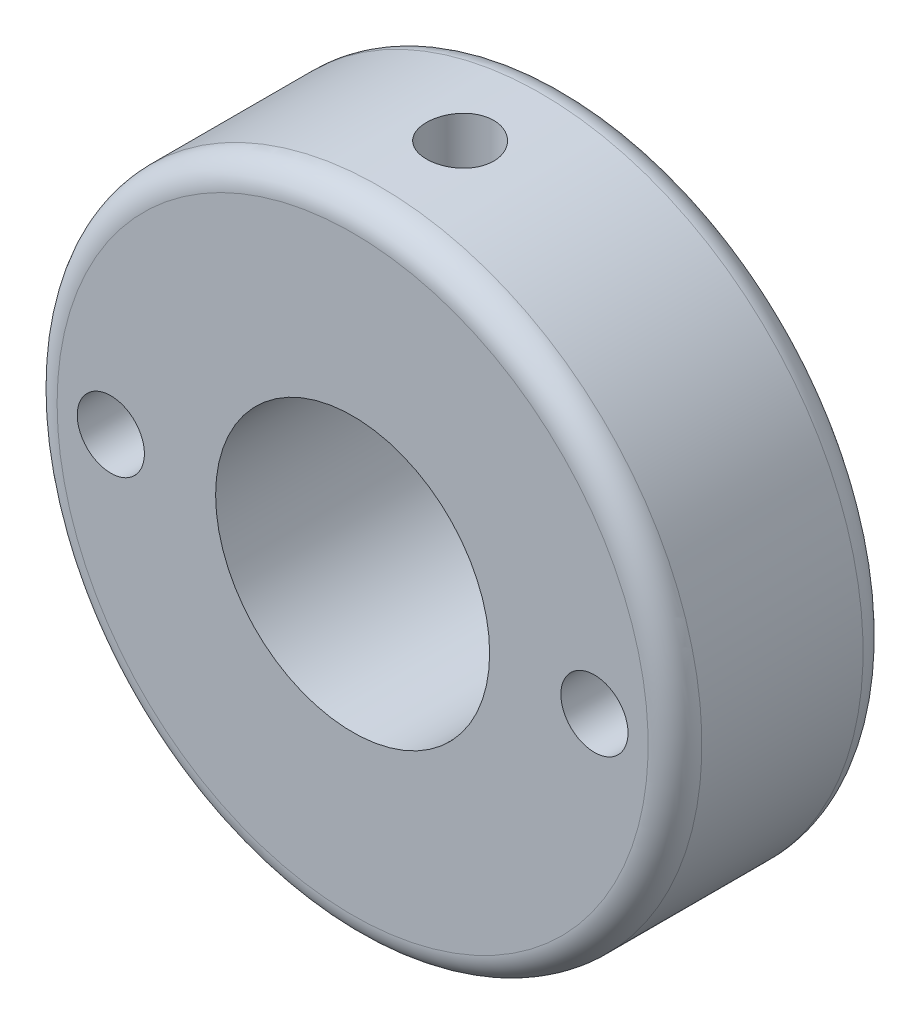
ISO-10303-21;
HEADER;
FILE_DESCRIPTION(('STEP AP214'),'2;1');
FILE_NAME('part.step','',(''),(''),'','','');
FILE_SCHEMA(('AUTOMOTIVE_DESIGN { 1 0 10303 214 1 1 1 1 }'));
ENDSEC;
DATA;
#1=APPLICATION_CONTEXT('core data for automotive mechanical design processes');
#2=APPLICATION_PROTOCOL_DEFINITION('international standard','automotive_design',2000,#1);
#3=PRODUCT_CONTEXT('',#1,'mechanical');
#4=PRODUCT('Part','Part','',(#3));
#5=PRODUCT_RELATED_PRODUCT_CATEGORY('part','',(#4));
#6=PRODUCT_DEFINITION_FORMATION('','',#4);
#7=PRODUCT_DEFINITION_CONTEXT('part definition',#1,'design');
#8=PRODUCT_DEFINITION('design','',#6,#7);
#9=PRODUCT_DEFINITION_SHAPE('','',#8);
#10=(LENGTH_UNIT() NAMED_UNIT(*) SI_UNIT(.MILLI.,.METRE.));
#11=(NAMED_UNIT(*) PLANE_ANGLE_UNIT() SI_UNIT($,.RADIAN.));
#12=(NAMED_UNIT(*) SI_UNIT($,.STERADIAN.) SOLID_ANGLE_UNIT());
#13=UNCERTAINTY_MEASURE_WITH_UNIT(LENGTH_MEASURE(1.E-05),#10,'distance_accuracy_value','');
#14=(GEOMETRIC_REPRESENTATION_CONTEXT(3) GLOBAL_UNCERTAINTY_ASSIGNED_CONTEXT((#13)) GLOBAL_UNIT_ASSIGNED_CONTEXT((#10,
#11,#12)) REPRESENTATION_CONTEXT('',''));
#15=CARTESIAN_POINT('',(0.,0.,0.));
#16=DIRECTION('',(0.,0.,1.));
#17=DIRECTION('',(1.,0.,0.));
#18=AXIS2_PLACEMENT_3D('',#15,#16,#17);
#19=CARTESIAN_POINT('',(0.,0.,0.));
#20=DIRECTION('',(0.,0.,-1.));
#21=DIRECTION('',(-1.,0.,0.));
#22=AXIS2_PLACEMENT_3D('',#19,#20,#21);
#23=PLANE('',#22);
#24=CARTESIAN_POINT('',(0.,0.,0.));
#25=DIRECTION('',(0.,0.,-1.));
#26=DIRECTION('',(-1.,0.,0.));
#27=AXIS2_PLACEMENT_3D('',#24,#25,#26);
#28=CIRCLE('',#27,11.);
#29=CARTESIAN_POINT('',(-11.,0.,0.));
#30=VERTEX_POINT('',#29);
#31=EDGE_CURVE('E50',#30,#30,#28,.T.);
#32=ORIENTED_EDGE('',*,*,#31,.T.);
#33=EDGE_LOOP('',(#32));
#34=FACE_BOUND('',#33,.T.);
#35=CARTESIAN_POINT('',(0.,0.,0.));
#36=DIRECTION('',(0.,0.,-1.));
#37=DIRECTION('',(-1.,0.,0.));
#38=AXIS2_PLACEMENT_3D('',#35,#36,#37);
#39=CIRCLE('',#38,5.09999999999999);
#40=CARTESIAN_POINT('',(-5.09999999999999,0.,0.));
#41=VERTEX_POINT('',#40);
#42=EDGE_CURVE('E106',#41,#41,#39,.T.);
#43=ORIENTED_EDGE('',*,*,#42,.F.);
#44=EDGE_LOOP('',(#43));
#45=FACE_BOUND('',#44,.T.);
#46=CARTESIAN_POINT('',(9.,0.,0.));
#47=DIRECTION('',(0.,0.,1.));
#48=DIRECTION('',(1.,0.,0.));
#49=AXIS2_PLACEMENT_3D('',#46,#47,#48);
#50=CIRCLE('',#49,1.25);
#51=CARTESIAN_POINT('',(10.25,0.,0.));
#52=VERTEX_POINT('',#51);
#53=EDGE_CURVE('E115',#52,#52,#50,.T.);
#54=ORIENTED_EDGE('',*,*,#53,.T.);
#55=EDGE_LOOP('',(#54));
#56=FACE_BOUND('',#55,.T.);
#57=CARTESIAN_POINT('',(-9.,0.,0.));
#58=DIRECTION('',(0.,0.,1.));
#59=DIRECTION('',(1.,0.,0.));
#60=AXIS2_PLACEMENT_3D('',#57,#58,#59);
#61=CIRCLE('',#60,1.25);
#62=CARTESIAN_POINT('',(-7.75,0.,0.));
#63=VERTEX_POINT('',#62);
#64=EDGE_CURVE('E63',#63,#63,#61,.T.);
#65=ORIENTED_EDGE('',*,*,#64,.T.);
#66=EDGE_LOOP('',(#65));
#67=FACE_BOUND('',#66,.T.);
#68=ADVANCED_FACE('F35',(#34,#45,#56,#67),#23,.T.);
#69=CARTESIAN_POINT('',(0.,0.,8.));
#70=DIRECTION('',(0.,0.,-1.));
#71=DIRECTION('',(-1.,0.,0.));
#72=AXIS2_PLACEMENT_3D('',#69,#70,#71);
#73=PLANE('',#72);
#74=CARTESIAN_POINT('',(0.,0.,8.));
#75=DIRECTION('',(0.,0.,-1.));
#76=DIRECTION('',(-1.,0.,0.));
#77=AXIS2_PLACEMENT_3D('',#74,#75,#76);
#78=CIRCLE('',#77,11.);
#79=CARTESIAN_POINT('',(-11.,0.,8.));
#80=VERTEX_POINT('',#79);
#81=EDGE_CURVE('E10',#80,#80,#78,.F.);
#82=ORIENTED_EDGE('',*,*,#81,.T.);
#83=EDGE_LOOP('',(#82));
#84=FACE_BOUND('',#83,.T.);
#85=CARTESIAN_POINT('',(0.,0.,8.));
#86=DIRECTION('',(0.,0.,-1.));
#87=DIRECTION('',(-1.,0.,0.));
#88=AXIS2_PLACEMENT_3D('',#85,#86,#87);
#89=CIRCLE('',#88,5.1);
#90=CARTESIAN_POINT('',(-5.1,0.,8.));
#91=VERTEX_POINT('',#90);
#92=EDGE_CURVE('E109',#91,#91,#89,.T.);
#93=ORIENTED_EDGE('',*,*,#92,.T.);
#94=EDGE_LOOP('',(#93));
#95=FACE_BOUND('',#94,.T.);
#96=CARTESIAN_POINT('',(9.,0.,8.));
#97=DIRECTION('',(0.,0.,1.));
#98=DIRECTION('',(1.,0.,0.));
#99=AXIS2_PLACEMENT_3D('',#96,#97,#98);
#100=CIRCLE('',#99,1.24999999999999);
#101=CARTESIAN_POINT('',(10.25,0.,8.));
#102=VERTEX_POINT('',#101);
#103=EDGE_CURVE('E112',#102,#102,#100,.T.);
#104=ORIENTED_EDGE('',*,*,#103,.F.);
#105=EDGE_LOOP('',(#104));
#106=FACE_BOUND('',#105,.T.);
#107=CARTESIAN_POINT('',(-9.,0.,8.));
#108=DIRECTION('',(0.,0.,1.));
#109=DIRECTION('',(1.,0.,0.));
#110=AXIS2_PLACEMENT_3D('',#107,#108,#109);
#111=CIRCLE('',#110,1.24999999999999);
#112=CARTESIAN_POINT('',(-7.75000000000001,0.,8.));
#113=VERTEX_POINT('',#112);
#114=EDGE_CURVE('E117',#113,#113,#111,.T.);
#115=ORIENTED_EDGE('',*,*,#114,.F.);
#116=EDGE_LOOP('',(#115));
#117=FACE_BOUND('',#116,.T.);
#118=ADVANCED_FACE('F83',(#84,#95,#106,#117),#73,.F.);
#119=CARTESIAN_POINT('',(0.,12.,4.));
#120=DIRECTION('',(0.,1.,0.));
#121=DIRECTION('',(0.,0.,1.));
#122=AXIS2_PLACEMENT_3D('',#119,#120,#121);
#123=CYLINDRICAL_SURFACE('',#122,1.25);
#124=CARTESIAN_POINT('',(0.,5.09999999999999,5.25));
#125=CARTESIAN_POINT('',(0.0691070684996926,5.09999880434978,5.24999798348912));
#126=CARTESIAN_POINT('',(0.138236944418446,5.09858131536653,5.24424976228371));
#127=CARTESIAN_POINT('',(0.274518328542682,5.09306394414273,5.22144143704133));
#128=CARTESIAN_POINT('',(0.34166864286499,5.08896247642348,5.20437464682425));
#129=CARTESIAN_POINT('',(0.472002952228092,5.07853173481306,5.15950744461656));
#130=CARTESIAN_POINT('',(0.535191508483103,5.07220508043731,5.13171964980311));
#131=CARTESIAN_POINT('',(0.656009783807286,5.05799923545459,5.06624292525055));
#132=CARTESIAN_POINT('',(0.71363936848209,5.0501200073264,5.02855375621661));
#133=CARTESIAN_POINT('',(0.822848252966838,5.03349079831523,4.94355356167072));
#134=CARTESIAN_POINT('',(0.874301457474936,5.02472780422833,4.89608306460642));
#135=CARTESIAN_POINT('',(0.968601490513419,5.00740600303305,4.79320930927441));
#136=CARTESIAN_POINT('',(1.01144738348377,4.99884721820992,4.7378051897922));
#137=CARTESIAN_POINT('',(1.0879035028578,4.98277220490615,4.61966554841211));
#138=CARTESIAN_POINT('',(1.1213738013313,4.9752725239875,4.55683701406763));
#139=CARTESIAN_POINT('',(1.17722916418205,4.96235417524495,4.42623185816075));
#140=CARTESIAN_POINT('',(1.1996159254181,4.95693518890103,4.35845599584475));
#141=CARTESIAN_POINT('',(1.23224077227212,4.94892534918551,4.22126367528795));
#142=CARTESIAN_POINT('',(1.24270502580646,4.94628192270403,4.15190414045871));
#143=CARTESIAN_POINT('',(1.2518920997985,4.94396505119134,4.01236752907348));
#144=CARTESIAN_POINT('',(1.25061675182797,4.94429114286616,3.94219058175357));
#145=CARTESIAN_POINT('',(1.23654152995141,4.94782914866116,3.80473582774668));
#146=CARTESIAN_POINT('',(1.22401001756152,4.95097385953439,3.73742854252081));
#147=CARTESIAN_POINT('',(1.1882058016209,4.95968781619625,3.60590195017532));
#148=CARTESIAN_POINT('',(1.16493235940441,4.9652572287173,3.54168285574965));
#149=CARTESIAN_POINT('',(1.10807335491486,4.97825548132943,3.4174302741977));
#150=CARTESIAN_POINT('',(1.07438945055792,4.98570192341188,3.35744370782828));
#151=CARTESIAN_POINT('',(0.997734518212743,5.00160513396374,3.24387753755934));
#152=CARTESIAN_POINT('',(0.954761923411038,5.01006207277567,3.1902990169383));
#153=CARTESIAN_POINT('',(0.859354317594719,5.0273172510606,3.08953072281942));
#154=CARTESIAN_POINT('',(0.806692545166494,5.03611849726845,3.04255590209154));
#155=CARTESIAN_POINT('',(0.694134178054514,5.05286158733432,2.95806440738741));
#156=CARTESIAN_POINT('',(0.634237379008401,5.06080340690473,2.92054800066832));
#157=CARTESIAN_POINT('',(0.508609859612949,5.07496988361231,2.85596369665685));
#158=CARTESIAN_POINT('',(0.442861095774588,5.0811889683056,2.82892959578838));
#159=CARTESIAN_POINT('',(0.307566171137275,5.09116862078236,2.78635681179117));
#160=CARTESIAN_POINT('',(0.238020710248733,5.09492964005614,2.77081601753633));
#161=CARTESIAN_POINT('',(0.0989453142746338,5.09950300203925,2.75199667883517));
#162=CARTESIAN_POINT('',(0.0294572667514425,5.10038575477826,2.74842526946549));
#163=CARTESIAN_POINT('',(-0.109123373763242,5.09930312829892,2.75284439063548));
#164=CARTESIAN_POINT('',(-0.178216000365267,5.09733799487026,2.76083392339635));
#165=CARTESIAN_POINT('',(-0.313034626367914,5.09082541313748,2.78790645272338));
#166=CARTESIAN_POINT('',(-0.378794452619994,5.08631494103105,2.8068306926693));
#167=CARTESIAN_POINT('',(-0.506203454443048,5.07521932825951,2.85505495923954));
#168=CARTESIAN_POINT('',(-0.567852223717142,5.06863398290121,2.88435600960628));
#169=CARTESIAN_POINT('',(-0.686461955962985,5.05394953642362,2.95307669338877));
#170=CARTESIAN_POINT('',(-0.743324059126193,5.04582634854576,2.9926616864597));
#171=CARTESIAN_POINT('',(-0.849702675725458,5.02900694161716,3.08061419666594));
#172=CARTESIAN_POINT('',(-0.899217970898001,5.02031062787396,3.12898316742856));
#173=CARTESIAN_POINT('',(-0.990696382723898,5.00307328773868,3.23448809131635));
#174=CARTESIAN_POINT('',(-1.03245444963733,4.99454072619954,3.29180350705718));
#175=CARTESIAN_POINT('',(-1.10575822346969,4.97882613595569,3.41280212648627));
#176=CARTESIAN_POINT('',(-1.13730438667597,4.97164404691532,3.47648504549588));
#177=CARTESIAN_POINT('',(-1.1890561697623,4.95952136957445,3.60806601778778));
#178=CARTESIAN_POINT('',(-1.20932893763628,4.95456754355924,3.67593637844542));
#179=CARTESIAN_POINT('',(-1.23813945980661,4.94744732527485,3.81426126330338));
#180=CARTESIAN_POINT('',(-1.24667966231571,4.9452803514844,3.88471524523299));
#181=CARTESIAN_POINT('',(-1.25165848529287,4.94402228162177,4.02412423175996));
#182=CARTESIAN_POINT('',(-1.2484243607539,4.94484800382851,4.09306698903094));
#183=CARTESIAN_POINT('',(-1.2306924450603,4.94929065899865,4.22939209851615));
#184=CARTESIAN_POINT('',(-1.21619486349272,4.952907540025,4.29677447974137));
#185=CARTESIAN_POINT('',(-1.17652305640477,4.96247954352292,4.42772609531758));
#186=CARTESIAN_POINT('',(-1.15140795267151,4.96842170466239,4.49131425279892));
#187=CARTESIAN_POINT('',(-1.09126121671284,4.98197703107666,4.61341874530864));
#188=CARTESIAN_POINT('',(-1.05622826264649,4.98959041906045,4.67193440292061));
#189=CARTESIAN_POINT('',(-0.976204563183666,5.00586943046763,4.78381959942419));
#190=CARTESIAN_POINT('',(-0.930985706061682,5.01455668828479,4.8370228663445));
#191=CARTESIAN_POINT('',(-0.832321323332242,5.03187294207898,4.93519278657441));
#192=CARTESIAN_POINT('',(-0.778873858036762,5.04050192381696,4.9801574923623));
#193=CARTESIAN_POINT('',(-0.664158652901536,5.05690655619084,5.06132692040344));
#194=CARTESIAN_POINT('',(-0.602772094362001,5.06466495329149,5.09736745852573));
#195=CARTESIAN_POINT('',(-0.474628080310969,5.07827391506525,5.1585600387649));
#196=CARTESIAN_POINT('',(-0.407874627519972,5.08412588542531,5.18372010800249));
#197=CARTESIAN_POINT('',(-0.284339168519941,5.09236742668301,5.21857703254264));
#198=CARTESIAN_POINT('',(-0.228160130166596,5.09521030945107,5.23033568875331));
#199=CARTESIAN_POINT('',(-0.114659241633677,5.09902702732158,5.24604773842208));
#200=CARTESIAN_POINT('',(-0.0573374709725589,5.10000099201949,5.25000167307971));
#201=CARTESIAN_POINT('',(0.,5.09999999999999,5.25));
#202=B_SPLINE_CURVE_WITH_KNOTS('',3,(#124,#125,#126,#127,#128,#129,#130,#131,#132,#133,#134,
#135,#136,#137,#138,#139,#140,#141,#142,#143,#144,#145,#146,#147,#148,#149,#150,#151,#152,#153,
#154,#155,#156,#157,#158,#159,#160,#161,#162,#163,#164,#165,#166,#167,#168,#169,#170,#171,#172,
#173,#174,#175,#176,#177,#178,#179,#180,#181,#182,#183,#184,#185,#186,#187,#188,#189,#190,#191,
#192,#193,#194,#195,#196,#197,#198,#199,#200,#201),.UNSPECIFIED.,.T.,.F.,(4,2,2,2,2,2,2,2,2,2,2,
2,2,2,2,2,2,2,2,2,2,2,2,2,2,2,2,2,2,2,2,2,2,2,2,2,2,2,4),(0.,0.207111126001139,0.41434470716714,
0.621335142633989,0.828330581073009,1.03901413705267,1.2497205806197,1.46342191841655,
1.67709052900647,1.88663462873632,2.09614603667921,2.30079124414467,2.50545052607678,
2.71210547153032,2.91879530271746,3.1311412630626,3.34349322278761,3.5565242523478,
3.76951614198416,3.97725697741624,4.1849798846347,4.38976012844558,4.59456058084085,
4.80288334137089,5.01124060791518,5.22449909344891,5.4377480488709,5.64971283372678,
5.8616333815604,6.06770935164209,6.27378148721518,6.47872095452595,6.68368774882848,
6.8938052669521,7.10397239106231,7.31775867260691,7.53138696205187,7.70323699097113,
7.87507510294715),.UNSPECIFIED.);
#203=CARTESIAN_POINT('',(0.,5.09999999999999,5.25));
#204=VERTEX_POINT('',#203);
#205=EDGE_CURVE('E100',#204,#204,#202,.T.);
#206=ORIENTED_EDGE('',*,*,#205,.F.);
#207=EDGE_LOOP('',(#206));
#208=FACE_BOUND('',#207,.T.);
#209=CARTESIAN_POINT('',(0.,12.,5.25));
#210=CARTESIAN_POINT('',(-0.0700095494879671,11.9999991642872,5.2499969762198));
#211=CARTESIAN_POINT('',(-0.140065002410053,11.9993808287118,5.24409858880724));
#212=CARTESIAN_POINT('',(-0.278232608485379,11.9969736264618,5.22065842267707));
#213=CARTESIAN_POINT('',(-0.346342552614998,11.9951834804073,5.20310391753797));
#214=CARTESIAN_POINT('',(-0.478598413117925,11.9906346712346,5.15686904993407));
#215=CARTESIAN_POINT('',(-0.542746737320354,11.9878766033589,5.12819552419516));
#216=CARTESIAN_POINT('',(-0.665306503912529,11.9817001005453,5.06055009056835));
#217=CARTESIAN_POINT('',(-0.723719060185855,11.9782817942095,5.02158018767916));
#218=CARTESIAN_POINT('',(-0.833390013644793,11.9711526751922,4.9342857046386));
#219=CARTESIAN_POINT('',(-0.884622960494006,11.9674408914449,4.88592922665563));
#220=CARTESIAN_POINT('',(-0.97826156200066,11.9601511575164,4.78130238768988));
#221=CARTESIAN_POINT('',(-1.02066680237567,11.9565732136228,4.72503165550036));
#222=CARTESIAN_POINT('',(-1.09553719669395,11.9499464131795,4.60601329465089));
#223=CARTESIAN_POINT('',(-1.12797918293742,11.9468987968275,4.54325101700315));
#224=CARTESIAN_POINT('',(-1.18185422718569,11.9416898936638,4.41313259718966));
#225=CARTESIAN_POINT('',(-1.20328757896304,11.9395285832006,4.34577657766525));
#226=CARTESIAN_POINT('',(-1.23446116549206,11.936345872896,4.20864305129333));
#227=CARTESIAN_POINT('',(-1.24424374803227,11.9353203457101,4.13887526847352));
#228=CARTESIAN_POINT('',(-1.25196903004635,11.9345125354877,3.99868114385109));
#229=CARTESIAN_POINT('',(-1.24991206557194,11.9347302171641,3.928254820797));
#230=CARTESIAN_POINT('',(-1.23405152506975,11.9363804586047,3.78903516041441));
#231=CARTESIAN_POINT('',(-1.22029424848266,11.9378082298324,3.72023648368824));
#232=CARTESIAN_POINT('',(-1.18149567318239,11.9417102992231,3.58592983869555));
#233=CARTESIAN_POINT('',(-1.1564542103875,11.9441846126035,3.52042191829483));
#234=CARTESIAN_POINT('',(-1.09574719612483,11.9499064730575,3.39441042493858));
#235=CARTESIAN_POINT('',(-1.06006116722708,11.953155508059,3.33391678745412));
#236=CARTESIAN_POINT('',(-0.979092720135939,11.9600594875767,3.21975979654472));
#237=CARTESIAN_POINT('',(-0.933809997063839,11.9637144449871,3.16609666020563));
#238=CARTESIAN_POINT('',(-0.834675280938104,11.9710397802306,3.0668549726774));
#239=CARTESIAN_POINT('',(-0.78078331415784,11.97471014815,3.02131634185813));
#240=CARTESIAN_POINT('',(-0.666098532189394,11.9816362536886,2.93992596711748));
#241=CARTESIAN_POINT('',(-0.60530570822991,11.9848919907809,2.90407423550878));
#242=CARTESIAN_POINT('',(-0.478516764921767,11.9906232037876,2.84307671344585));
#243=CARTESIAN_POINT('',(-0.412519629297687,11.9930985268321,2.81793302017716));
#244=CARTESIAN_POINT('',(-0.277208837646706,11.9969884809875,2.77909493630869));
#245=CARTESIAN_POINT('',(-0.2078952893403,11.9984031465247,2.7654001741024));
#246=CARTESIAN_POINT('',(-0.068264858693871,12.0000079610362,2.74989950611508));
#247=CARTESIAN_POINT('',(0.00204584741646015,12.0002037822377,2.74803852769015));
#248=CARTESIAN_POINT('',(0.141978142720367,11.9993640699192,2.75611350212647));
#249=CARTESIAN_POINT('',(0.211599742015271,11.9983285544758,2.76604928180499));
#250=CARTESIAN_POINT('',(0.348018029476926,11.995146140952,2.79739003282191));
#251=CARTESIAN_POINT('',(0.414820721686736,11.9930017489258,2.81876914610542));
#252=CARTESIAN_POINT('',(0.543891723826279,11.98784207376,2.8723630692795));
#253=CARTESIAN_POINT('',(0.606159923902424,11.9848267695301,2.9045781415782));
#254=CARTESIAN_POINT('',(0.724642919002308,11.9782482392504,2.97906558931992));
#255=CARTESIAN_POINT('',(0.780834909391516,11.9746830631459,3.02137406378974));
#256=CARTESIAN_POINT('',(0.885339382882749,11.9674108977167,3.11479567897704));
#257=CARTESIAN_POINT('',(0.933651650991104,11.9637039045259,3.16590905985308));
#258=CARTESIAN_POINT('',(1.02121712756248,11.9565487724948,3.27573022069048));
#259=CARTESIAN_POINT('',(1.06043413579884,11.9531017036895,3.33446694435446));
#260=CARTESIAN_POINT('',(1.12844682402802,11.9468731948153,3.45772506440109));
#261=CARTESIAN_POINT('',(1.15724265694647,11.9440917449791,3.52224637588042));
#262=CARTESIAN_POINT('',(1.2035352838692,11.9395161797365,3.65511911684399));
#263=CARTESIAN_POINT('',(1.22105344529625,11.9377201981564,3.72346303501599));
#264=CARTESIAN_POINT('',(1.24436270906373,11.9353131909021,3.86214200140165));
#265=CARTESIAN_POINT('',(1.25015417898762,11.9347021280856,3.93247698713348));
#266=CARTESIAN_POINT('',(1.24984031256419,11.9347349734758,4.07278169021094));
#267=CARTESIAN_POINT('',(1.24379184136804,11.9353728830911,4.14275154309785));
#268=CARTESIAN_POINT('',(1.22008919679213,11.9378189905869,4.28067522718867));
#269=CARTESIAN_POINT('',(1.20243501187647,11.9396271896308,4.3486290563886));
#270=CARTESIAN_POINT('',(1.15603809633997,11.9442084445198,4.48059021369322));
#271=CARTESIAN_POINT('',(1.12729720150595,11.9469813406187,4.54459819313525));
#272=CARTESIAN_POINT('',(1.05954851165036,11.9531798687626,4.66689090167718));
#273=CARTESIAN_POINT('',(1.02054074557837,11.9566054989671,4.7251756469143));
#274=CARTESIAN_POINT('',(0.933152337738087,11.9637432302473,4.83465878064127));
#275=CARTESIAN_POINT('',(0.884729299095298,11.9674565796301,4.88582324804603));
#276=CARTESIAN_POINT('',(0.779969862539384,11.9747399925001,4.97932465526141));
#277=CARTESIAN_POINT('',(0.723631576825858,11.9783100215432,5.02165948318541));
#278=CARTESIAN_POINT('',(0.604472478145271,11.9849147120146,5.09639142865715));
#279=CARTESIAN_POINT('',(0.541634534666211,11.9879478984777,5.12876134258304));
#280=CARTESIAN_POINT('',(0.411422843814935,11.9931213369361,5.18244649130877));
#281=CARTESIAN_POINT('',(0.344054279006827,11.9952625896922,5.20377412225424));
#282=CARTESIAN_POINT('',(0.230257563143006,11.9978761527569,5.22948318245997));
#283=CARTESIAN_POINT('',(0.184555489720074,11.998668856663,5.23716639549184));
#284=CARTESIAN_POINT('',(0.0925756340610835,11.999731055421,5.2474257924199));
#285=CARTESIAN_POINT('',(0.0462978544563027,12.0000005526633,5.25000199964914));
#286=CARTESIAN_POINT('',(0.,12.,5.25));
#287=B_SPLINE_CURVE_WITH_KNOTS('',3,(#209,#210,#211,#212,#213,#214,#215,#216,#217,#218,#219,
#220,#221,#222,#223,#224,#225,#226,#227,#228,#229,#230,#231,#232,#233,#234,#235,#236,#237,#238,
#239,#240,#241,#242,#243,#244,#245,#246,#247,#248,#249,#250,#251,#252,#253,#254,#255,#256,#257,
#258,#259,#260,#261,#262,#263,#264,#265,#266,#267,#268,#269,#270,#271,#272,#273,#274,#275,#276,
#277,#278,#279,#280,#281,#282,#283,#284,#285,#286),.UNSPECIFIED.,.T.,.F.,(4,2,2,2,2,2,2,2,2,2,2,
2,2,2,2,2,2,2,2,2,2,2,2,2,2,2,2,2,2,2,2,2,2,2,2,2,2,2,4),(0.,0.209859578808884,
0.419948664798437,0.62990877811076,0.839828036286578,1.05047354994535,1.26112894692693,
1.47227053850523,1.68340649534035,1.89377265772064,2.1041328491326,2.3136644742687,
2.52319914627208,2.73313953815067,2.94308660065496,3.15403842947492,3.36499052642714,
3.57598391968831,3.78697046431325,3.99697438635691,4.20697522546865,4.41650352486907,
4.62603689865994,4.83633120945248,5.04663125704429,5.25775448481458,5.46887461432944,
5.67959355518836,5.89030589077467,6.10000869487958,6.30971170742627,6.51938001130894,
6.72904772399434,6.93968239830693,7.15036739491245,7.36162255036675,7.57264003223293,
7.71142242261124,7.85020417891471),.UNSPECIFIED.);
#288=CARTESIAN_POINT('',(0.,12.,5.25));
#289=VERTEX_POINT('',#288);
#290=EDGE_CURVE('E55',#289,#289,#287,.T.);
#291=ORIENTED_EDGE('',*,*,#290,.F.);
#292=EDGE_LOOP('',(#291));
#293=FACE_BOUND('',#292,.T.);
#294=ADVANCED_FACE('F65',(#208,#293),#123,.F.);
#295=CARTESIAN_POINT('',(-9.,0.,8.));
#296=DIRECTION('',(0.,0.,1.));
#297=DIRECTION('',(1.,0.,0.));
#298=AXIS2_PLACEMENT_3D('',#295,#296,#297);
#299=CYLINDRICAL_SURFACE('',#298,1.24999999999999);
#300=ORIENTED_EDGE('',*,*,#64,.F.);
#301=EDGE_LOOP('',(#300));
#302=FACE_BOUND('',#301,.T.);
#303=ORIENTED_EDGE('',*,*,#114,.T.);
#304=EDGE_LOOP('',(#303));
#305=FACE_BOUND('',#304,.T.);
#306=ADVANCED_FACE('F92',(#302,#305),#299,.F.);
#307=CARTESIAN_POINT('',(9.,0.,8.));
#308=DIRECTION('',(0.,0.,1.));
#309=DIRECTION('',(1.,0.,0.));
#310=AXIS2_PLACEMENT_3D('',#307,#308,#309);
#311=CYLINDRICAL_SURFACE('',#310,1.24999999999999);
#312=ORIENTED_EDGE('',*,*,#53,.F.);
#313=EDGE_LOOP('',(#312));
#314=FACE_BOUND('',#313,.T.);
#315=ORIENTED_EDGE('',*,*,#103,.T.);
#316=EDGE_LOOP('',(#315));
#317=FACE_BOUND('',#316,.T.);
#318=ADVANCED_FACE('F78',(#314,#317),#311,.F.);
#319=CARTESIAN_POINT('',(0.,0.,0.));
#320=DIRECTION('',(0.,0.,-1.));
#321=DIRECTION('',(-1.,0.,0.));
#322=AXIS2_PLACEMENT_3D('',#319,#320,#321);
#323=CYLINDRICAL_SURFACE('',#322,5.09999999999999);
#324=ORIENTED_EDGE('',*,*,#205,.T.);
#325=EDGE_LOOP('',(#324));
#326=FACE_BOUND('',#325,.T.);
#327=ORIENTED_EDGE('',*,*,#92,.F.);
#328=EDGE_LOOP('',(#327));
#329=FACE_BOUND('',#328,.T.);
#330=ORIENTED_EDGE('',*,*,#42,.T.);
#331=EDGE_LOOP('',(#330));
#332=FACE_BOUND('',#331,.T.);
#333=ADVANCED_FACE('F72',(#326,#329,#332),#323,.F.);
#334=CARTESIAN_POINT('',(0.,0.,10.));
#335=DIRECTION('',(0.,0.,-1.));
#336=DIRECTION('',(-1.,0.,0.));
#337=AXIS2_PLACEMENT_3D('',#334,#335,#336);
#338=CYLINDRICAL_SURFACE('',#337,12.);
#339=CARTESIAN_POINT('',(0.,0.,0.999999999999999));
#340=DIRECTION('',(0.,0.,-1.));
#341=DIRECTION('',(-1.,0.,0.));
#342=AXIS2_PLACEMENT_3D('',#339,#340,#341);
#343=CIRCLE('',#342,12.);
#344=CARTESIAN_POINT('',(-12.,0.,0.999999999999999));
#345=VERTEX_POINT('',#344);
#346=EDGE_CURVE('E42',#345,#345,#343,.F.);
#347=ORIENTED_EDGE('',*,*,#346,.T.);
#348=EDGE_LOOP('',(#347));
#349=FACE_BOUND('',#348,.T.);
#350=CARTESIAN_POINT('',(0.,0.,7.));
#351=DIRECTION('',(0.,0.,-1.));
#352=DIRECTION('',(-1.,0.,0.));
#353=AXIS2_PLACEMENT_3D('',#350,#351,#352);
#354=CIRCLE('',#353,12.);
#355=CARTESIAN_POINT('',(-12.,0.,7.));
#356=VERTEX_POINT('',#355);
#357=EDGE_CURVE('E46',#356,#356,#354,.T.);
#358=ORIENTED_EDGE('',*,*,#357,.T.);
#359=EDGE_LOOP('',(#358));
#360=FACE_BOUND('',#359,.T.);
#361=ORIENTED_EDGE('',*,*,#290,.T.);
#362=EDGE_LOOP('',(#361));
#363=FACE_BOUND('',#362,.T.);
#364=ADVANCED_FACE('F68',(#349,#360,#363),#338,.T.);
#365=CARTESIAN_POINT('',(0.,0.,0.999999999999999));
#366=DIRECTION('',(0.,0.,-1.));
#367=DIRECTION('',(-1.,0.,0.));
#368=AXIS2_PLACEMENT_3D('',#365,#366,#367);
#369=TOROIDAL_SURFACE('',#368,11.,1.);
#370=ORIENTED_EDGE('',*,*,#346,.F.);
#371=EDGE_LOOP('',(#370));
#372=FACE_BOUND('',#371,.T.);
#373=ORIENTED_EDGE('',*,*,#31,.F.);
#374=EDGE_LOOP('',(#373));
#375=FACE_BOUND('',#374,.T.);
#376=ADVANCED_FACE('F71',(#372,#375),#369,.T.);
#377=CARTESIAN_POINT('',(0.,0.,7.));
#378=DIRECTION('',(0.,0.,-1.));
#379=DIRECTION('',(-1.,0.,0.));
#380=AXIS2_PLACEMENT_3D('',#377,#378,#379);
#381=TOROIDAL_SURFACE('',#380,11.,1.);
#382=ORIENTED_EDGE('',*,*,#81,.F.);
#383=EDGE_LOOP('',(#382));
#384=FACE_BOUND('',#383,.T.);
#385=ORIENTED_EDGE('',*,*,#357,.F.);
#386=EDGE_LOOP('',(#385));
#387=FACE_BOUND('',#386,.T.);
#388=ADVANCED_FACE('F37',(#384,#387),#381,.T.);
#389=CLOSED_SHELL('',(#68,#118,#294,#306,#318,#333,#364,#376,#388));
#390=MANIFOLD_SOLID_BREP('B2',#389);
#391=ADVANCED_BREP_SHAPE_REPRESENTATION('',(#18,#390),#14);
#392=SHAPE_DEFINITION_REPRESENTATION(#9,#391);
ENDSEC;
END-ISO-10303-21;
